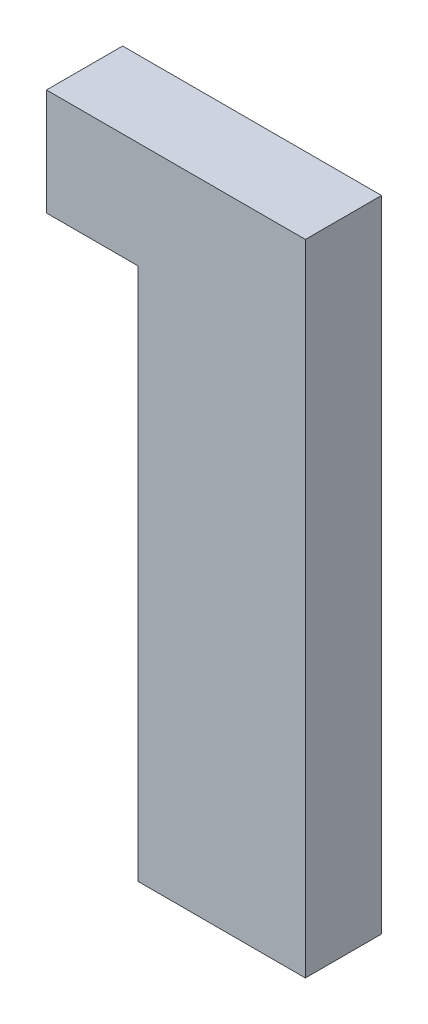
ISO-10303-21;
HEADER;
FILE_DESCRIPTION(('STEP AP214'),'2;1');
FILE_NAME('part.step','',(''),(''),'','','');
FILE_SCHEMA(('AUTOMOTIVE_DESIGN { 1 0 10303 214 1 1 1 1 }'));
ENDSEC;
DATA;
#1=APPLICATION_CONTEXT('core data for automotive mechanical design processes');
#2=APPLICATION_PROTOCOL_DEFINITION('international standard','automotive_design',2000,#1);
#3=PRODUCT_CONTEXT('',#1,'mechanical');
#4=PRODUCT('Part','Part','',(#3));
#5=PRODUCT_RELATED_PRODUCT_CATEGORY('part','',(#4));
#6=PRODUCT_DEFINITION_FORMATION('','',#4);
#7=PRODUCT_DEFINITION_CONTEXT('part definition',#1,'design');
#8=PRODUCT_DEFINITION('design','',#6,#7);
#9=PRODUCT_DEFINITION_SHAPE('','',#8);
#10=(LENGTH_UNIT() NAMED_UNIT(*) SI_UNIT(.MILLI.,.METRE.));
#11=(NAMED_UNIT(*) PLANE_ANGLE_UNIT() SI_UNIT($,.RADIAN.));
#12=(NAMED_UNIT(*) SI_UNIT($,.STERADIAN.) SOLID_ANGLE_UNIT());
#13=UNCERTAINTY_MEASURE_WITH_UNIT(LENGTH_MEASURE(1.E-05),#10,'distance_accuracy_value','');
#14=(GEOMETRIC_REPRESENTATION_CONTEXT(3) GLOBAL_UNCERTAINTY_ASSIGNED_CONTEXT((#13)) GLOBAL_UNIT_ASSIGNED_CONTEXT((#10,
#11,#12)) REPRESENTATION_CONTEXT('',''));
#15=CARTESIAN_POINT('',(0.,0.,0.));
#16=DIRECTION('',(0.,0.,1.));
#17=DIRECTION('',(1.,0.,0.));
#18=AXIS2_PLACEMENT_3D('',#15,#16,#17);
#19=CARTESIAN_POINT('',(0.,53.34,6.35));
#20=DIRECTION('',(0.,-1.,0.));
#21=DIRECTION('',(0.,0.,-1.));
#22=AXIS2_PLACEMENT_3D('',#19,#20,#21);
#23=PLANE('',#22);
#24=DIRECTION('',(-1.,0.,0.));
#25=VECTOR('',#24,1.);
#26=CARTESIAN_POINT('',(0.,53.34,0.));
#27=LINE('',#26,#25);
#28=CARTESIAN_POINT('',(0.,53.34,0.));
#29=VERTEX_POINT('',#28);
#30=CARTESIAN_POINT('',(-21.59,53.34,0.));
#31=VERTEX_POINT('',#30);
#32=EDGE_CURVE('E187',#29,#31,#27,.T.);
#33=ORIENTED_EDGE('',*,*,#32,.T.);
#34=DIRECTION('',(0.,0.,-1.));
#35=VECTOR('',#34,1.);
#36=CARTESIAN_POINT('',(-21.59,53.34,6.35));
#37=LINE('',#36,#35);
#38=CARTESIAN_POINT('',(-21.59,53.34,6.35));
#39=VERTEX_POINT('',#38);
#40=EDGE_CURVE('E234',#39,#31,#37,.T.);
#41=ORIENTED_EDGE('',*,*,#40,.F.);
#42=DIRECTION('',(-1.,0.,0.));
#43=VECTOR('',#42,1.);
#44=CARTESIAN_POINT('',(0.,53.34,6.35));
#45=LINE('',#44,#43);
#46=CARTESIAN_POINT('',(0.,53.34,6.35));
#47=VERTEX_POINT('',#46);
#48=EDGE_CURVE('E191',#47,#39,#45,.T.);
#49=ORIENTED_EDGE('',*,*,#48,.F.);
#50=DIRECTION('',(0.,0.,-1.));
#51=VECTOR('',#50,1.);
#52=CARTESIAN_POINT('',(0.,53.34,6.35));
#53=LINE('',#52,#51);
#54=EDGE_CURVE('E208',#47,#29,#53,.T.);
#55=ORIENTED_EDGE('',*,*,#54,.T.);
#56=EDGE_LOOP('',(#33,#41,#49,#55));
#57=FACE_BOUND('',#56,.T.);
#58=ADVANCED_FACE('F41',(#57),#23,.F.);
#59=CARTESIAN_POINT('',(-21.59,0.,6.35));
#60=DIRECTION('',(1.,0.,0.));
#61=DIRECTION('',(0.,0.,-1.));
#62=AXIS2_PLACEMENT_3D('',#59,#60,#61);
#63=PLANE('',#62);
#64=DIRECTION('',(0.,-1.,0.));
#65=VECTOR('',#64,1.);
#66=CARTESIAN_POINT('',(-21.59,0.,0.));
#67=LINE('',#66,#65);
#68=CARTESIAN_POINT('',(-21.59,44.45,0.));
#69=VERTEX_POINT('',#68);
#70=EDGE_CURVE('E211',#31,#69,#67,.T.);
#71=ORIENTED_EDGE('',*,*,#70,.T.);
#72=DIRECTION('',(0.,0.,-1.));
#73=VECTOR('',#72,1.);
#74=CARTESIAN_POINT('',(-21.59,44.45,6.35));
#75=LINE('',#74,#73);
#76=CARTESIAN_POINT('',(-21.59,44.45,6.35));
#77=VERTEX_POINT('',#76);
#78=EDGE_CURVE('E232',#77,#69,#75,.T.);
#79=ORIENTED_EDGE('',*,*,#78,.F.);
#80=DIRECTION('',(0.,-1.,0.));
#81=VECTOR('',#80,1.);
#82=CARTESIAN_POINT('',(-21.59,0.,6.35));
#83=LINE('',#82,#81);
#84=EDGE_CURVE('E194',#39,#77,#83,.T.);
#85=ORIENTED_EDGE('',*,*,#84,.F.);
#86=ORIENTED_EDGE('',*,*,#40,.T.);
#87=EDGE_LOOP('',(#71,#79,#85,#86));
#88=FACE_BOUND('',#87,.T.);
#89=ADVANCED_FACE('F284',(#88),#63,.F.);
#90=CARTESIAN_POINT('',(0.,44.45,6.35));
#91=DIRECTION('',(0.,-1.,0.));
#92=DIRECTION('',(0.,0.,-1.));
#93=AXIS2_PLACEMENT_3D('',#90,#91,#92);
#94=PLANE('',#93);
#95=DIRECTION('',(-1.,0.,0.));
#96=VECTOR('',#95,1.);
#97=CARTESIAN_POINT('',(0.,44.45,0.));
#98=LINE('',#97,#96);
#99=CARTESIAN_POINT('',(-13.97,44.45,0.));
#100=VERTEX_POINT('',#99);
#101=EDGE_CURVE('E214',#100,#69,#98,.T.);
#102=ORIENTED_EDGE('',*,*,#101,.F.);
#103=DIRECTION('',(0.,0.,-1.));
#104=VECTOR('',#103,1.);
#105=CARTESIAN_POINT('',(-13.97,44.45,6.35));
#106=LINE('',#105,#104);
#107=CARTESIAN_POINT('',(-13.97,44.45,6.35));
#108=VERTEX_POINT('',#107);
#109=EDGE_CURVE('E230',#108,#100,#106,.T.);
#110=ORIENTED_EDGE('',*,*,#109,.F.);
#111=DIRECTION('',(-1.,0.,0.));
#112=VECTOR('',#111,1.);
#113=CARTESIAN_POINT('',(0.,44.45,6.35));
#114=LINE('',#113,#112);
#115=EDGE_CURVE('E197',#108,#77,#114,.T.);
#116=ORIENTED_EDGE('',*,*,#115,.T.);
#117=ORIENTED_EDGE('',*,*,#78,.T.);
#118=EDGE_LOOP('',(#102,#110,#116,#117));
#119=FACE_BOUND('',#118,.T.);
#120=ADVANCED_FACE('F289',(#119),#94,.T.);
#121=CARTESIAN_POINT('',(-13.97,0.,6.35));
#122=DIRECTION('',(-1.,0.,0.));
#123=DIRECTION('',(0.,0.,1.));
#124=AXIS2_PLACEMENT_3D('',#121,#122,#123);
#125=PLANE('',#124);
#126=DIRECTION('',(0.,1.,0.));
#127=VECTOR('',#126,1.);
#128=CARTESIAN_POINT('',(-13.97,0.,0.));
#129=LINE('',#128,#127);
#130=CARTESIAN_POINT('',(-13.97,0.,0.));
#131=VERTEX_POINT('',#130);
#132=EDGE_CURVE('E217',#131,#100,#129,.T.);
#133=ORIENTED_EDGE('',*,*,#132,.F.);
#134=DIRECTION('',(0.,0.,-1.));
#135=VECTOR('',#134,1.);
#136=CARTESIAN_POINT('',(-13.97,0.,6.35));
#137=LINE('',#136,#135);
#138=CARTESIAN_POINT('',(-13.97,0.,6.35));
#139=VERTEX_POINT('',#138);
#140=EDGE_CURVE('E228',#139,#131,#137,.T.);
#141=ORIENTED_EDGE('',*,*,#140,.F.);
#142=DIRECTION('',(0.,1.,0.));
#143=VECTOR('',#142,1.);
#144=CARTESIAN_POINT('',(-13.97,0.,6.35));
#145=LINE('',#144,#143);
#146=EDGE_CURVE('E200',#139,#108,#145,.T.);
#147=ORIENTED_EDGE('',*,*,#146,.T.);
#148=ORIENTED_EDGE('',*,*,#109,.T.);
#149=EDGE_LOOP('',(#133,#141,#147,#148));
#150=FACE_BOUND('',#149,.T.);
#151=ADVANCED_FACE('F311',(#150),#125,.T.);
#152=CARTESIAN_POINT('',(0.,0.,6.35));
#153=DIRECTION('',(0.,-1.,0.));
#154=DIRECTION('',(1.,0.,0.));
#155=AXIS2_PLACEMENT_3D('',#152,#153,#154);
#156=PLANE('',#155);
#157=DIRECTION('',(-1.,0.,0.));
#158=VECTOR('',#157,1.);
#159=CARTESIAN_POINT('',(0.,0.,0.));
#160=LINE('',#159,#158);
#161=CARTESIAN_POINT('',(0.,0.,0.));
#162=VERTEX_POINT('',#161);
#163=EDGE_CURVE('E220',#162,#131,#160,.T.);
#164=ORIENTED_EDGE('',*,*,#163,.F.);
#165=DIRECTION('',(0.,0.,-1.));
#166=VECTOR('',#165,1.);
#167=CARTESIAN_POINT('',(0.,0.,6.35));
#168=LINE('',#167,#166);
#169=CARTESIAN_POINT('',(0.,0.,6.35));
#170=VERTEX_POINT('',#169);
#171=EDGE_CURVE('E226',#170,#162,#168,.T.);
#172=ORIENTED_EDGE('',*,*,#171,.F.);
#173=DIRECTION('',(-1.,0.,0.));
#174=VECTOR('',#173,1.);
#175=CARTESIAN_POINT('',(0.,0.,6.35));
#176=LINE('',#175,#174);
#177=EDGE_CURVE('E203',#170,#139,#176,.T.);
#178=ORIENTED_EDGE('',*,*,#177,.T.);
#179=ORIENTED_EDGE('',*,*,#140,.T.);
#180=EDGE_LOOP('',(#164,#172,#178,#179));
#181=FACE_BOUND('',#180,.T.);
#182=ADVANCED_FACE('F308',(#181),#156,.T.);
#183=CARTESIAN_POINT('',(0.,0.,6.35));
#184=DIRECTION('',(-1.,0.,0.));
#185=DIRECTION('',(0.,-1.,0.));
#186=AXIS2_PLACEMENT_3D('',#183,#184,#185);
#187=PLANE('',#186);
#188=DIRECTION('',(0.,1.,0.));
#189=VECTOR('',#188,1.);
#190=CARTESIAN_POINT('',(0.,0.,0.));
#191=LINE('',#190,#189);
#192=EDGE_CURVE('E195',#162,#29,#191,.T.);
#193=ORIENTED_EDGE('',*,*,#192,.T.);
#194=ORIENTED_EDGE('',*,*,#54,.F.);
#195=DIRECTION('',(0.,1.,0.));
#196=VECTOR('',#195,1.);
#197=CARTESIAN_POINT('',(0.,0.,6.35));
#198=LINE('',#197,#196);
#199=EDGE_CURVE('E206',#170,#47,#198,.T.);
#200=ORIENTED_EDGE('',*,*,#199,.F.);
#201=ORIENTED_EDGE('',*,*,#171,.T.);
#202=EDGE_LOOP('',(#193,#194,#200,#201));
#203=FACE_BOUND('',#202,.T.);
#204=ADVANCED_FACE('F306',(#203),#187,.F.);
#205=CARTESIAN_POINT('',(0.,0.,6.35));
#206=DIRECTION('',(0.,0.,1.));
#207=DIRECTION('',(1.,0.,0.));
#208=AXIS2_PLACEMENT_3D('',#205,#206,#207);
#209=PLANE('',#208);
#210=ORIENTED_EDGE('',*,*,#48,.T.);
#211=ORIENTED_EDGE('',*,*,#84,.T.);
#212=ORIENTED_EDGE('',*,*,#115,.F.);
#213=ORIENTED_EDGE('',*,*,#146,.F.);
#214=ORIENTED_EDGE('',*,*,#177,.F.);
#215=ORIENTED_EDGE('',*,*,#199,.T.);
#216=EDGE_LOOP('',(#210,#211,#212,#213,#214,#215));
#217=FACE_BOUND('',#216,.T.);
#218=ADVANCED_FACE('F301',(#217),#209,.T.);
#219=CARTESIAN_POINT('',(0.,0.,0.));
#220=DIRECTION('',(0.,0.,1.));
#221=DIRECTION('',(1.,0.,0.));
#222=AXIS2_PLACEMENT_3D('',#219,#220,#221);
#223=PLANE('',#222);
#224=CARTESIAN_POINT('',(-6.985,15.24,0.));
#225=DIRECTION('',(0.,0.,-1.));
#226=DIRECTION('',(-1.,0.,0.));
#227=AXIS2_PLACEMENT_3D('',#224,#225,#226);
#228=CIRCLE('',#227,4.0005);
#229=CARTESIAN_POINT('',(-9.017,11.7939912579914,0.));
#230=VERTEX_POINT('',#229);
#231=CARTESIAN_POINT('',(-9.017,18.6860087420086,0.));
#232=VERTEX_POINT('',#231);
#233=EDGE_CURVE('E179',#230,#232,#228,.T.);
#234=ORIENTED_EDGE('',*,*,#233,.F.);
#235=DIRECTION('',(0.,1.,0.));
#236=VECTOR('',#235,1.);
#237=CARTESIAN_POINT('',(-9.017,15.24,0.));
#238=LINE('',#237,#236);
#239=CARTESIAN_POINT('',(-9.017,0.762000000000001,0.));
#240=VERTEX_POINT('',#239);
#241=EDGE_CURVE('E149',#240,#230,#238,.T.);
#242=ORIENTED_EDGE('',*,*,#241,.F.);
#243=DIRECTION('',(-1.,0.,0.));
#244=VECTOR('',#243,1.);
#245=CARTESIAN_POINT('',(-4.953,0.762000000000001,0.));
#246=LINE('',#245,#244);
#247=CARTESIAN_POINT('',(-4.953,0.762000000000001,0.));
#248=VERTEX_POINT('',#247);
#249=EDGE_CURVE('E173',#248,#240,#246,.T.);
#250=ORIENTED_EDGE('',*,*,#249,.F.);
#251=DIRECTION('',(0.,-1.,0.));
#252=VECTOR('',#251,1.);
#253=CARTESIAN_POINT('',(-4.953,15.24,0.));
#254=LINE('',#253,#252);
#255=CARTESIAN_POINT('',(-4.953,11.7939912579914,0.));
#256=VERTEX_POINT('',#255);
#257=EDGE_CURVE('E170',#256,#248,#254,.T.);
#258=ORIENTED_EDGE('',*,*,#257,.F.);
#259=CARTESIAN_POINT('',(-4.953,18.6860087420086,0.));
#260=VERTEX_POINT('',#259);
#261=EDGE_CURVE('E188',#260,#256,#228,.T.);
#262=ORIENTED_EDGE('',*,*,#261,.F.);
#263=CARTESIAN_POINT('',(-4.953,29.718,0.));
#264=VERTEX_POINT('',#263);
#265=EDGE_CURVE('E171',#264,#260,#254,.T.);
#266=ORIENTED_EDGE('',*,*,#265,.F.);
#267=DIRECTION('',(1.,0.,0.));
#268=VECTOR('',#267,1.);
#269=CARTESIAN_POINT('',(-6.985,29.718,0.));
#270=LINE('',#269,#268);
#271=CARTESIAN_POINT('',(-9.017,29.718,0.));
#272=VERTEX_POINT('',#271);
#273=EDGE_CURVE('E168',#272,#264,#270,.T.);
#274=ORIENTED_EDGE('',*,*,#273,.F.);
#275=EDGE_CURVE('E155',#232,#272,#238,.T.);
#276=ORIENTED_EDGE('',*,*,#275,.F.);
#277=EDGE_LOOP('',(#234,#242,#250,#258,#262,#266,#274,#276));
#278=FACE_BOUND('',#277,.T.);
#279=ORIENTED_EDGE('',*,*,#32,.F.);
#280=ORIENTED_EDGE('',*,*,#192,.F.);
#281=ORIENTED_EDGE('',*,*,#163,.T.);
#282=ORIENTED_EDGE('',*,*,#132,.T.);
#283=ORIENTED_EDGE('',*,*,#101,.T.);
#284=ORIENTED_EDGE('',*,*,#70,.F.);
#285=EDGE_LOOP('',(#279,#280,#281,#282,#283,#284));
#286=FACE_BOUND('',#285,.T.);
#287=ADVANCED_FACE('F265',(#278,#286),#223,.F.);
#288=CARTESIAN_POINT('',(-6.985,15.24,2.794));
#289=DIRECTION('',(0.,0.,-1.));
#290=DIRECTION('',(-1.,0.,0.));
#291=AXIS2_PLACEMENT_3D('',#288,#289,#290);
#292=CYLINDRICAL_SURFACE('',#291,4.0005);
#293=CARTESIAN_POINT('',(-6.985,15.24,1.5875));
#294=DIRECTION('',(0.,0.,1.));
#295=DIRECTION('',(1.,0.,0.));
#296=AXIS2_PLACEMENT_3D('',#293,#294,#295);
#297=CIRCLE('',#296,4.0005);
#298=CARTESIAN_POINT('',(-4.953,11.7939912579914,1.5875));
#299=VERTEX_POINT('',#298);
#300=CARTESIAN_POINT('',(-9.017,11.7939912579914,1.5875));
#301=VERTEX_POINT('',#300);
#302=EDGE_CURVE('E239',#299,#301,#297,.F.);
#303=ORIENTED_EDGE('',*,*,#302,.T.);
#304=DIRECTION('',(0.,0.,-1.));
#305=VECTOR('',#304,1.);
#306=CARTESIAN_POINT('',(-9.017,11.7939912579914,2.794));
#307=LINE('',#306,#305);
#308=EDGE_CURVE('E11',#301,#230,#307,.T.);
#309=ORIENTED_EDGE('',*,*,#308,.T.);
#310=ORIENTED_EDGE('',*,*,#233,.T.);
#311=DIRECTION('',(0.,0.,-1.));
#312=VECTOR('',#311,1.);
#313=CARTESIAN_POINT('',(-9.017,18.6860087420086,2.794));
#314=LINE('',#313,#312);
#315=CARTESIAN_POINT('',(-9.017,18.6860087420086,1.5875));
#316=VERTEX_POINT('',#315);
#317=EDGE_CURVE('E242',#232,#316,#314,.F.);
#318=ORIENTED_EDGE('',*,*,#317,.T.);
#319=CARTESIAN_POINT('',(-4.953,18.6860087420086,1.5875));
#320=VERTEX_POINT('',#319);
#321=EDGE_CURVE('E146',#316,#320,#297,.F.);
#322=ORIENTED_EDGE('',*,*,#321,.T.);
#323=DIRECTION('',(0.,0.,-1.));
#324=VECTOR('',#323,1.);
#325=CARTESIAN_POINT('',(-4.953,18.6860087420086,2.794));
#326=LINE('',#325,#324);
#327=EDGE_CURVE('E238',#320,#260,#326,.T.);
#328=ORIENTED_EDGE('',*,*,#327,.T.);
#329=ORIENTED_EDGE('',*,*,#261,.T.);
#330=DIRECTION('',(0.,0.,-1.));
#331=VECTOR('',#330,1.);
#332=CARTESIAN_POINT('',(-4.953,11.7939912579914,2.794));
#333=LINE('',#332,#331);
#334=EDGE_CURVE('E48',#256,#299,#333,.F.);
#335=ORIENTED_EDGE('',*,*,#334,.T.);
#336=EDGE_LOOP('',(#303,#309,#310,#318,#322,#328,#329,#335));
#337=FACE_BOUND('',#336,.T.);
#338=CARTESIAN_POINT('',(-6.985,15.24,2.794));
#339=DIRECTION('',(0.,0.,-1.));
#340=DIRECTION('',(-1.,0.,0.));
#341=AXIS2_PLACEMENT_3D('',#338,#339,#340);
#342=CIRCLE('',#341,4.0005);
#343=CARTESIAN_POINT('',(-10.9855,15.24,2.794));
#344=VERTEX_POINT('',#343);
#345=EDGE_CURVE('E184',#344,#344,#342,.T.);
#346=ORIENTED_EDGE('',*,*,#345,.F.);
#347=EDGE_LOOP('',(#346));
#348=FACE_BOUND('',#347,.T.);
#349=ADVANCED_FACE('F247',(#337,#348),#292,.F.);
#350=CARTESIAN_POINT('',(-6.985,15.24,2.794));
#351=DIRECTION('',(0.,0.,-1.));
#352=DIRECTION('',(-1.,0.,0.));
#353=AXIS2_PLACEMENT_3D('',#350,#351,#352);
#354=PLANE('',#353);
#355=ORIENTED_EDGE('',*,*,#345,.T.);
#356=EDGE_LOOP('',(#355));
#357=FACE_BOUND('',#356,.T.);
#358=ADVANCED_FACE('F278',(#357),#354,.T.);
#359=CARTESIAN_POINT('',(0.,0.,1.5875));
#360=DIRECTION('',(0.,0.,1.));
#361=DIRECTION('',(1.,0.,0.));
#362=AXIS2_PLACEMENT_3D('',#359,#360,#361);
#363=PLANE('',#362);
#364=DIRECTION('',(0.,1.,0.));
#365=VECTOR('',#364,1.);
#366=CARTESIAN_POINT('',(-9.017,15.24,1.5875));
#367=LINE('',#366,#365);
#368=CARTESIAN_POINT('',(-9.017,29.718,1.5875));
#369=VERTEX_POINT('',#368);
#370=EDGE_CURVE('E139',#316,#369,#367,.T.);
#371=ORIENTED_EDGE('',*,*,#370,.T.);
#372=DIRECTION('',(1.,0.,0.));
#373=VECTOR('',#372,1.);
#374=CARTESIAN_POINT('',(-6.985,29.718,1.5875));
#375=LINE('',#374,#373);
#376=CARTESIAN_POINT('',(-4.953,29.718,1.5875));
#377=VERTEX_POINT('',#376);
#378=EDGE_CURVE('E143',#369,#377,#375,.T.);
#379=ORIENTED_EDGE('',*,*,#378,.T.);
#380=DIRECTION('',(0.,-1.,0.));
#381=VECTOR('',#380,1.);
#382=CARTESIAN_POINT('',(-4.953,15.24,1.5875));
#383=LINE('',#382,#381);
#384=EDGE_CURVE('E63',#377,#320,#383,.T.);
#385=ORIENTED_EDGE('',*,*,#384,.T.);
#386=ORIENTED_EDGE('',*,*,#321,.F.);
#387=EDGE_LOOP('',(#371,#379,#385,#386));
#388=FACE_BOUND('',#387,.T.);
#389=ADVANCED_FACE('F141',(#388),#363,.F.);
#390=CARTESIAN_POINT('',(-4.953,15.24,1.5875));
#391=DIRECTION('',(1.,0.,0.));
#392=DIRECTION('',(0.,1.,0.));
#393=AXIS2_PLACEMENT_3D('',#390,#391,#392);
#394=PLANE('',#393);
#395=ORIENTED_EDGE('',*,*,#384,.F.);
#396=DIRECTION('',(0.,0.,-1.));
#397=VECTOR('',#396,1.);
#398=CARTESIAN_POINT('',(-4.953,29.718,1.5875));
#399=LINE('',#398,#397);
#400=EDGE_CURVE('E159',#377,#264,#399,.T.);
#401=ORIENTED_EDGE('',*,*,#400,.T.);
#402=ORIENTED_EDGE('',*,*,#265,.T.);
#403=ORIENTED_EDGE('',*,*,#327,.F.);
#404=EDGE_LOOP('',(#395,#401,#402,#403));
#405=FACE_BOUND('',#404,.T.);
#406=ADVANCED_FACE('F270',(#405),#394,.F.);
#407=CARTESIAN_POINT('',(-9.017,15.24,1.5875));
#408=DIRECTION('',(-1.,0.,0.));
#409=DIRECTION('',(0.,-1.,0.));
#410=AXIS2_PLACEMENT_3D('',#407,#408,#409);
#411=PLANE('',#410);
#412=ORIENTED_EDGE('',*,*,#275,.T.);
#413=DIRECTION('',(0.,0.,-1.));
#414=VECTOR('',#413,1.);
#415=CARTESIAN_POINT('',(-9.017,29.718,1.5875));
#416=LINE('',#415,#414);
#417=EDGE_CURVE('E152',#369,#272,#416,.T.);
#418=ORIENTED_EDGE('',*,*,#417,.F.);
#419=ORIENTED_EDGE('',*,*,#370,.F.);
#420=ORIENTED_EDGE('',*,*,#317,.F.);
#421=EDGE_LOOP('',(#412,#418,#419,#420));
#422=FACE_BOUND('',#421,.T.);
#423=ADVANCED_FACE('F153',(#422),#411,.F.);
#424=CARTESIAN_POINT('',(-6.985,29.718,1.5875));
#425=DIRECTION('',(0.,1.,0.));
#426=DIRECTION('',(0.,0.,1.));
#427=AXIS2_PLACEMENT_3D('',#424,#425,#426);
#428=PLANE('',#427);
#429=ORIENTED_EDGE('',*,*,#273,.T.);
#430=ORIENTED_EDGE('',*,*,#400,.F.);
#431=ORIENTED_EDGE('',*,*,#378,.F.);
#432=ORIENTED_EDGE('',*,*,#417,.T.);
#433=EDGE_LOOP('',(#429,#430,#431,#432));
#434=FACE_BOUND('',#433,.T.);
#435=ADVANCED_FACE('F162',(#434),#428,.F.);
#436=CARTESIAN_POINT('',(-9.017,0.762000000000001,1.5875));
#437=VERTEX_POINT('',#436);
#438=EDGE_CURVE('E55',#437,#301,#367,.T.);
#439=ORIENTED_EDGE('',*,*,#438,.F.);
#440=DIRECTION('',(0.,0.,-1.));
#441=VECTOR('',#440,1.);
#442=CARTESIAN_POINT('',(-9.017,0.762000000000001,1.5875));
#443=LINE('',#442,#441);
#444=EDGE_CURVE('E177',#437,#240,#443,.T.);
#445=ORIENTED_EDGE('',*,*,#444,.T.);
#446=ORIENTED_EDGE('',*,*,#241,.T.);
#447=ORIENTED_EDGE('',*,*,#308,.F.);
#448=EDGE_LOOP('',(#439,#445,#446,#447));
#449=FACE_BOUND('',#448,.T.);
#450=ADVANCED_FACE('F263',(#449),#411,.F.);
#451=ORIENTED_EDGE('',*,*,#257,.T.);
#452=DIRECTION('',(0.,0.,-1.));
#453=VECTOR('',#452,1.);
#454=CARTESIAN_POINT('',(-4.953,0.762000000000001,1.5875));
#455=LINE('',#454,#453);
#456=CARTESIAN_POINT('',(-4.953,0.762000000000001,1.5875));
#457=VERTEX_POINT('',#456);
#458=EDGE_CURVE('E180',#457,#248,#455,.T.);
#459=ORIENTED_EDGE('',*,*,#458,.F.);
#460=EDGE_CURVE('E163',#299,#457,#383,.T.);
#461=ORIENTED_EDGE('',*,*,#460,.F.);
#462=ORIENTED_EDGE('',*,*,#334,.F.);
#463=EDGE_LOOP('',(#451,#459,#461,#462));
#464=FACE_BOUND('',#463,.T.);
#465=ADVANCED_FACE('F254',(#464),#394,.F.);
#466=ORIENTED_EDGE('',*,*,#460,.T.);
#467=DIRECTION('',(-1.,0.,0.));
#468=VECTOR('',#467,1.);
#469=CARTESIAN_POINT('',(-4.953,0.762000000000001,1.5875));
#470=LINE('',#469,#468);
#471=EDGE_CURVE('E160',#457,#437,#470,.T.);
#472=ORIENTED_EDGE('',*,*,#471,.T.);
#473=ORIENTED_EDGE('',*,*,#438,.T.);
#474=ORIENTED_EDGE('',*,*,#302,.F.);
#475=EDGE_LOOP('',(#466,#472,#473,#474));
#476=FACE_BOUND('',#475,.T.);
#477=ADVANCED_FACE('F251',(#476),#363,.F.);
#478=CARTESIAN_POINT('',(-4.953,0.762000000000001,1.5875));
#479=DIRECTION('',(0.,-1.,0.));
#480=DIRECTION('',(0.,0.,-1.));
#481=AXIS2_PLACEMENT_3D('',#478,#479,#480);
#482=PLANE('',#481);
#483=ORIENTED_EDGE('',*,*,#249,.T.);
#484=ORIENTED_EDGE('',*,*,#444,.F.);
#485=ORIENTED_EDGE('',*,*,#471,.F.);
#486=ORIENTED_EDGE('',*,*,#458,.T.);
#487=EDGE_LOOP('',(#483,#484,#485,#486));
#488=FACE_BOUND('',#487,.T.);
#489=ADVANCED_FACE('F260',(#488),#482,.F.);
#490=CLOSED_SHELL('',(#58,#89,#120,#151,#182,#204,#218,#287,#349,#358,#389,#406,#423,#435,#450,
#465,#477,#489));
#491=MANIFOLD_SOLID_BREP('B2',#490);
#492=ADVANCED_BREP_SHAPE_REPRESENTATION('',(#18,#491),#14);
#493=SHAPE_DEFINITION_REPRESENTATION(#9,#492);
ENDSEC;
END-ISO-10303-21;
